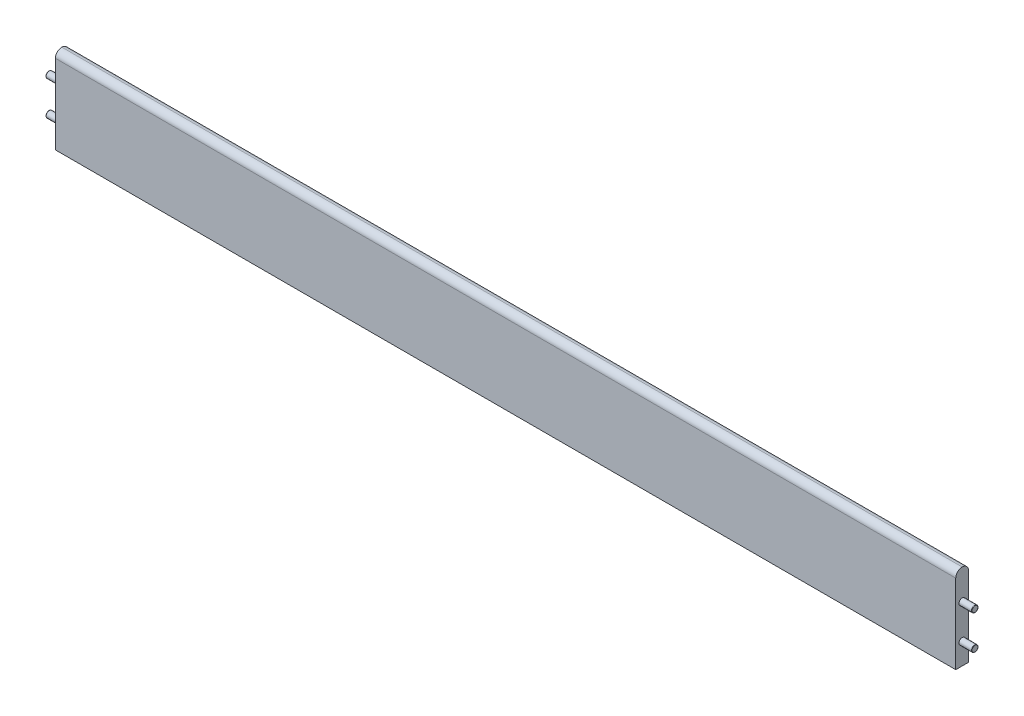
ISO-10303-21;
HEADER;
FILE_DESCRIPTION(('STEP AP214'),'2;1');
FILE_NAME('part.step','',(''),(''),'','','');
FILE_SCHEMA(('AUTOMOTIVE_DESIGN { 1 0 10303 214 1 1 1 1 }'));
ENDSEC;
DATA;
#1=APPLICATION_CONTEXT('core data for automotive mechanical design processes');
#2=APPLICATION_PROTOCOL_DEFINITION('international standard','automotive_design',2000,#1);
#3=PRODUCT_CONTEXT('',#1,'mechanical');
#4=PRODUCT('Part','Part','',(#3));
#5=PRODUCT_RELATED_PRODUCT_CATEGORY('part','',(#4));
#6=PRODUCT_DEFINITION_FORMATION('','',#4);
#7=PRODUCT_DEFINITION_CONTEXT('part definition',#1,'design');
#8=PRODUCT_DEFINITION('design','',#6,#7);
#9=PRODUCT_DEFINITION_SHAPE('','',#8);
#10=(LENGTH_UNIT() NAMED_UNIT(*) SI_UNIT(.MILLI.,.METRE.));
#11=(NAMED_UNIT(*) PLANE_ANGLE_UNIT() SI_UNIT($,.RADIAN.));
#12=(NAMED_UNIT(*) SI_UNIT($,.STERADIAN.) SOLID_ANGLE_UNIT());
#13=UNCERTAINTY_MEASURE_WITH_UNIT(LENGTH_MEASURE(1.E-05),#10,'distance_accuracy_value','');
#14=(GEOMETRIC_REPRESENTATION_CONTEXT(3) GLOBAL_UNCERTAINTY_ASSIGNED_CONTEXT((#13)) GLOBAL_UNIT_ASSIGNED_CONTEXT((#10,
#11,#12)) REPRESENTATION_CONTEXT('',''));
#15=CARTESIAN_POINT('',(0.,0.,0.));
#16=DIRECTION('',(0.,0.,1.));
#17=DIRECTION('',(1.,0.,0.));
#18=AXIS2_PLACEMENT_3D('',#15,#16,#17);
#19=CARTESIAN_POINT('',(0.,0.,30.));
#20=DIRECTION('',(1.,0.,0.));
#21=DIRECTION('',(0.,1.,0.));
#22=AXIS2_PLACEMENT_3D('',#19,#20,#21);
#23=PLANE('',#22);
#24=CARTESIAN_POINT('',(0.,-150.,15.));
#25=DIRECTION('',(1.,0.,0.));
#26=DIRECTION('',(0.,1.,0.));
#27=AXIS2_PLACEMENT_3D('',#24,#25,#26);
#28=CIRCLE('',#27,7.5);
#29=CARTESIAN_POINT('',(0.,-142.5,15.));
#30=VERTEX_POINT('',#29);
#31=EDGE_CURVE('E139',#30,#30,#28,.F.);
#32=ORIENTED_EDGE('',*,*,#31,.F.);
#33=EDGE_LOOP('',(#32));
#34=FACE_BOUND('',#33,.T.);
#35=CARTESIAN_POINT('',(0.,-70.,15.));
#36=DIRECTION('',(1.,0.,0.));
#37=DIRECTION('',(0.,1.,0.));
#38=AXIS2_PLACEMENT_3D('',#35,#36,#37);
#39=CIRCLE('',#38,7.5);
#40=CARTESIAN_POINT('',(0.,-62.5,15.));
#41=VERTEX_POINT('',#40);
#42=EDGE_CURVE('E136',#41,#41,#39,.F.);
#43=ORIENTED_EDGE('',*,*,#42,.F.);
#44=EDGE_LOOP('',(#43));
#45=FACE_BOUND('',#44,.T.);
#46=CARTESIAN_POINT('',(0.,-15.,15.));
#47=DIRECTION('',(1.,0.,0.));
#48=DIRECTION('',(0.,1.,0.));
#49=AXIS2_PLACEMENT_3D('',#46,#47,#48);
#50=CIRCLE('',#49,15.);
#51=CARTESIAN_POINT('',(0.,-15.,30.));
#52=VERTEX_POINT('',#51);
#53=CARTESIAN_POINT('',(0.,0.,15.));
#54=VERTEX_POINT('',#53);
#55=EDGE_CURVE('E101',#52,#54,#50,.F.);
#56=ORIENTED_EDGE('',*,*,#55,.T.);
#57=CARTESIAN_POINT('',(0.,-15.,15.));
#58=DIRECTION('',(1.,0.,0.));
#59=DIRECTION('',(0.,1.,0.));
#60=AXIS2_PLACEMENT_3D('',#57,#58,#59);
#61=CIRCLE('',#60,15.);
#62=CARTESIAN_POINT('',(0.,-15.,0.));
#63=VERTEX_POINT('',#62);
#64=EDGE_CURVE('E103',#54,#63,#61,.F.);
#65=ORIENTED_EDGE('',*,*,#64,.T.);
#66=DIRECTION('',(0.,-1.,0.));
#67=VECTOR('',#66,1.);
#68=CARTESIAN_POINT('',(0.,0.,0.));
#69=LINE('',#68,#67);
#70=CARTESIAN_POINT('',(0.,-200.,0.));
#71=VERTEX_POINT('',#70);
#72=EDGE_CURVE('E99',#63,#71,#69,.T.);
#73=ORIENTED_EDGE('',*,*,#72,.T.);
#74=DIRECTION('',(0.,0.,-1.));
#75=VECTOR('',#74,1.);
#76=CARTESIAN_POINT('',(0.,-200.,30.));
#77=LINE('',#76,#75);
#78=CARTESIAN_POINT('',(0.,-200.,30.));
#79=VERTEX_POINT('',#78);
#80=EDGE_CURVE('E93',#79,#71,#77,.T.);
#81=ORIENTED_EDGE('',*,*,#80,.F.);
#82=DIRECTION('',(0.,-1.,0.));
#83=VECTOR('',#82,1.);
#84=CARTESIAN_POINT('',(0.,0.,30.));
#85=LINE('',#84,#83);
#86=EDGE_CURVE('E78',#52,#79,#85,.T.);
#87=ORIENTED_EDGE('',*,*,#86,.F.);
#88=EDGE_LOOP('',(#56,#65,#73,#81,#87));
#89=FACE_BOUND('',#88,.T.);
#90=ADVANCED_FACE('F33',(#34,#45,#89),#23,.F.);
#91=CARTESIAN_POINT('',(0.,-200.,30.));
#92=DIRECTION('',(0.,1.,0.));
#93=DIRECTION('',(0.,0.,1.));
#94=AXIS2_PLACEMENT_3D('',#91,#92,#93);
#95=PLANE('',#94);
#96=DIRECTION('',(1.,0.,0.));
#97=VECTOR('',#96,1.);
#98=CARTESIAN_POINT('',(0.,-200.,0.));
#99=LINE('',#98,#97);
#100=CARTESIAN_POINT('',(2100.,-200.,0.));
#101=VERTEX_POINT('',#100);
#102=EDGE_CURVE('E227',#71,#101,#99,.T.);
#103=ORIENTED_EDGE('',*,*,#102,.T.);
#104=DIRECTION('',(0.,0.,-1.));
#105=VECTOR('',#104,1.);
#106=CARTESIAN_POINT('',(2100.,-200.,30.));
#107=LINE('',#106,#105);
#108=CARTESIAN_POINT('',(2100.,-200.,30.));
#109=VERTEX_POINT('',#108);
#110=EDGE_CURVE('E95',#109,#101,#107,.T.);
#111=ORIENTED_EDGE('',*,*,#110,.F.);
#112=DIRECTION('',(1.,0.,0.));
#113=VECTOR('',#112,1.);
#114=CARTESIAN_POINT('',(0.,-200.,30.));
#115=LINE('',#114,#113);
#116=EDGE_CURVE('E81',#79,#109,#115,.T.);
#117=ORIENTED_EDGE('',*,*,#116,.F.);
#118=ORIENTED_EDGE('',*,*,#80,.T.);
#119=EDGE_LOOP('',(#103,#111,#117,#118));
#120=FACE_BOUND('',#119,.T.);
#121=ADVANCED_FACE('F92',(#120),#95,.F.);
#122=CARTESIAN_POINT('',(2100.,0.,30.));
#123=DIRECTION('',(-1.,0.,0.));
#124=DIRECTION('',(0.,0.,1.));
#125=AXIS2_PLACEMENT_3D('',#122,#123,#124);
#126=PLANE('',#125);
#127=CARTESIAN_POINT('',(2100.,-150.,15.));
#128=DIRECTION('',(-1.,0.,0.));
#129=DIRECTION('',(0.,0.,1.));
#130=AXIS2_PLACEMENT_3D('',#127,#128,#129);
#131=CIRCLE('',#130,7.5);
#132=CARTESIAN_POINT('',(2100.,-150.,22.5));
#133=VERTEX_POINT('',#132);
#134=EDGE_CURVE('E121',#133,#133,#131,.F.);
#135=ORIENTED_EDGE('',*,*,#134,.F.);
#136=EDGE_LOOP('',(#135));
#137=FACE_BOUND('',#136,.T.);
#138=CARTESIAN_POINT('',(2100.,-70.,15.));
#139=DIRECTION('',(-1.,0.,0.));
#140=DIRECTION('',(0.,0.,1.));
#141=AXIS2_PLACEMENT_3D('',#138,#139,#140);
#142=CIRCLE('',#141,7.5);
#143=CARTESIAN_POINT('',(2100.,-70.,22.5));
#144=VERTEX_POINT('',#143);
#145=EDGE_CURVE('E115',#144,#144,#142,.F.);
#146=ORIENTED_EDGE('',*,*,#145,.F.);
#147=EDGE_LOOP('',(#146));
#148=FACE_BOUND('',#147,.T.);
#149=DIRECTION('',(0.,1.,0.));
#150=VECTOR('',#149,1.);
#151=CARTESIAN_POINT('',(2100.,0.,0.));
#152=LINE('',#151,#150);
#153=CARTESIAN_POINT('',(2100.,-15.,0.));
#154=VERTEX_POINT('',#153);
#155=EDGE_CURVE('E88',#101,#154,#152,.T.);
#156=ORIENTED_EDGE('',*,*,#155,.T.);
#157=CARTESIAN_POINT('',(2100.,-15.,15.));
#158=DIRECTION('',(-1.,0.,0.));
#159=DIRECTION('',(0.,0.,1.));
#160=AXIS2_PLACEMENT_3D('',#157,#158,#159);
#161=CIRCLE('',#160,15.);
#162=CARTESIAN_POINT('',(2100.,0.,15.));
#163=VERTEX_POINT('',#162);
#164=EDGE_CURVE('E53',#154,#163,#161,.F.);
#165=ORIENTED_EDGE('',*,*,#164,.T.);
#166=CARTESIAN_POINT('',(2100.,-15.,15.));
#167=DIRECTION('',(-1.,0.,0.));
#168=DIRECTION('',(0.,0.,1.));
#169=AXIS2_PLACEMENT_3D('',#166,#167,#168);
#170=CIRCLE('',#169,15.);
#171=CARTESIAN_POINT('',(2100.,-15.,30.));
#172=VERTEX_POINT('',#171);
#173=EDGE_CURVE('E48',#163,#172,#170,.F.);
#174=ORIENTED_EDGE('',*,*,#173,.T.);
#175=DIRECTION('',(0.,1.,0.));
#176=VECTOR('',#175,1.);
#177=CARTESIAN_POINT('',(2100.,0.,30.));
#178=LINE('',#177,#176);
#179=EDGE_CURVE('E96',#109,#172,#178,.T.);
#180=ORIENTED_EDGE('',*,*,#179,.F.);
#181=ORIENTED_EDGE('',*,*,#110,.T.);
#182=EDGE_LOOP('',(#156,#165,#174,#180,#181));
#183=FACE_BOUND('',#182,.T.);
#184=ADVANCED_FACE('F167',(#137,#148,#183),#126,.F.);
#185=CARTESIAN_POINT('',(0.,0.,30.));
#186=DIRECTION('',(0.,0.,1.));
#187=DIRECTION('',(1.,0.,0.));
#188=AXIS2_PLACEMENT_3D('',#185,#186,#187);
#189=PLANE('',#188);
#190=ORIENTED_EDGE('',*,*,#179,.T.);
#191=DIRECTION('',(-1.,0.,0.));
#192=VECTOR('',#191,1.);
#193=CARTESIAN_POINT('',(0.,-15.,30.));
#194=LINE('',#193,#192);
#195=EDGE_CURVE('E84',#172,#52,#194,.T.);
#196=ORIENTED_EDGE('',*,*,#195,.T.);
#197=ORIENTED_EDGE('',*,*,#86,.T.);
#198=ORIENTED_EDGE('',*,*,#116,.T.);
#199=EDGE_LOOP('',(#190,#196,#197,#198));
#200=FACE_BOUND('',#199,.T.);
#201=ADVANCED_FACE('F80',(#200),#189,.T.);
#202=CARTESIAN_POINT('',(0.,0.,0.));
#203=DIRECTION('',(0.,0.,1.));
#204=DIRECTION('',(1.,0.,0.));
#205=AXIS2_PLACEMENT_3D('',#202,#203,#204);
#206=PLANE('',#205);
#207=ORIENTED_EDGE('',*,*,#72,.F.);
#208=DIRECTION('',(-1.,0.,0.));
#209=VECTOR('',#208,1.);
#210=CARTESIAN_POINT('',(0.,-15.,0.));
#211=LINE('',#210,#209);
#212=EDGE_CURVE('E109',#63,#154,#211,.F.);
#213=ORIENTED_EDGE('',*,*,#212,.T.);
#214=ORIENTED_EDGE('',*,*,#155,.F.);
#215=ORIENTED_EDGE('',*,*,#102,.F.);
#216=EDGE_LOOP('',(#207,#213,#214,#215));
#217=FACE_BOUND('',#216,.T.);
#218=ADVANCED_FACE('F181',(#217),#206,.F.);
#219=CARTESIAN_POINT('',(0.,-15.,15.));
#220=DIRECTION('',(1.,0.,0.));
#221=DIRECTION('',(0.,0.,-1.));
#222=AXIS2_PLACEMENT_3D('',#219,#220,#221);
#223=CYLINDRICAL_SURFACE('',#222,15.);
#224=ORIENTED_EDGE('',*,*,#195,.F.);
#225=ORIENTED_EDGE('',*,*,#173,.F.);
#226=DIRECTION('',(-1.,0.,0.));
#227=VECTOR('',#226,1.);
#228=CARTESIAN_POINT('',(2100.,0.,15.));
#229=LINE('',#228,#227);
#230=EDGE_CURVE('E116',#54,#163,#229,.F.);
#231=ORIENTED_EDGE('',*,*,#230,.F.);
#232=ORIENTED_EDGE('',*,*,#55,.F.);
#233=EDGE_LOOP('',(#224,#225,#231,#232));
#234=FACE_BOUND('',#233,.T.);
#235=ADVANCED_FACE('F177',(#234),#223,.T.);
#236=CARTESIAN_POINT('',(0.,-15.,15.));
#237=DIRECTION('',(-1.,0.,0.));
#238=DIRECTION('',(0.,0.,1.));
#239=AXIS2_PLACEMENT_3D('',#236,#237,#238);
#240=CYLINDRICAL_SURFACE('',#239,15.);
#241=ORIENTED_EDGE('',*,*,#164,.F.);
#242=ORIENTED_EDGE('',*,*,#212,.F.);
#243=ORIENTED_EDGE('',*,*,#64,.F.);
#244=ORIENTED_EDGE('',*,*,#230,.T.);
#245=EDGE_LOOP('',(#241,#242,#243,#244));
#246=FACE_BOUND('',#245,.T.);
#247=ADVANCED_FACE('F173',(#246),#240,.T.);
#248=CARTESIAN_POINT('',(2130.,-70.,15.));
#249=DIRECTION('',(-1.,0.,0.));
#250=DIRECTION('',(0.,0.,1.));
#251=AXIS2_PLACEMENT_3D('',#248,#249,#250);
#252=CYLINDRICAL_SURFACE('',#251,7.5);
#253=CARTESIAN_POINT('',(2129.,-70.,15.));
#254=DIRECTION('',(1.,0.,0.));
#255=DIRECTION('',(0.,0.,-1.));
#256=AXIS2_PLACEMENT_3D('',#253,#254,#255);
#257=CIRCLE('',#256,7.5);
#258=CARTESIAN_POINT('',(2129.,-70.,7.5));
#259=VERTEX_POINT('',#258);
#260=EDGE_CURVE('E133',#259,#259,#257,.F.);
#261=ORIENTED_EDGE('',*,*,#260,.T.);
#262=EDGE_LOOP('',(#261));
#263=FACE_BOUND('',#262,.T.);
#264=ORIENTED_EDGE('',*,*,#145,.T.);
#265=EDGE_LOOP('',(#264));
#266=FACE_BOUND('',#265,.T.);
#267=ADVANCED_FACE('F176',(#263,#266),#252,.T.);
#268=CARTESIAN_POINT('',(2130.,-70.,15.));
#269=DIRECTION('',(1.,0.,0.));
#270=DIRECTION('',(0.,0.,-1.));
#271=AXIS2_PLACEMENT_3D('',#268,#269,#270);
#272=PLANE('',#271);
#273=CARTESIAN_POINT('',(2130.,-70.,15.));
#274=DIRECTION('',(1.,0.,0.));
#275=DIRECTION('',(0.,0.,-1.));
#276=AXIS2_PLACEMENT_3D('',#273,#274,#275);
#277=CIRCLE('',#276,6.5);
#278=CARTESIAN_POINT('',(2130.,-70.,8.49999999999999));
#279=VERTEX_POINT('',#278);
#280=EDGE_CURVE('E130',#279,#279,#277,.T.);
#281=ORIENTED_EDGE('',*,*,#280,.T.);
#282=EDGE_LOOP('',(#281));
#283=FACE_BOUND('',#282,.T.);
#284=ADVANCED_FACE('F201',(#283),#272,.T.);
#285=CARTESIAN_POINT('',(2130.,-150.,15.));
#286=DIRECTION('',(-1.,0.,0.));
#287=DIRECTION('',(0.,0.,1.));
#288=AXIS2_PLACEMENT_3D('',#285,#286,#287);
#289=CYLINDRICAL_SURFACE('',#288,7.5);
#290=CARTESIAN_POINT('',(2129.,-150.,15.));
#291=DIRECTION('',(1.,0.,0.));
#292=DIRECTION('',(0.,0.,-1.));
#293=AXIS2_PLACEMENT_3D('',#290,#291,#292);
#294=CIRCLE('',#293,7.5);
#295=CARTESIAN_POINT('',(2129.,-150.,7.5));
#296=VERTEX_POINT('',#295);
#297=EDGE_CURVE('E127',#296,#296,#294,.F.);
#298=ORIENTED_EDGE('',*,*,#297,.T.);
#299=EDGE_LOOP('',(#298));
#300=FACE_BOUND('',#299,.T.);
#301=ORIENTED_EDGE('',*,*,#134,.T.);
#302=EDGE_LOOP('',(#301));
#303=FACE_BOUND('',#302,.T.);
#304=ADVANCED_FACE('F203',(#300,#303),#289,.T.);
#305=CARTESIAN_POINT('',(2130.,-150.,15.));
#306=DIRECTION('',(1.,0.,0.));
#307=DIRECTION('',(0.,0.,-1.));
#308=AXIS2_PLACEMENT_3D('',#305,#306,#307);
#309=PLANE('',#308);
#310=CARTESIAN_POINT('',(2130.,-150.,15.));
#311=DIRECTION('',(1.,0.,0.));
#312=DIRECTION('',(0.,0.,-1.));
#313=AXIS2_PLACEMENT_3D('',#310,#311,#312);
#314=CIRCLE('',#313,6.5);
#315=CARTESIAN_POINT('',(2130.,-150.,8.5));
#316=VERTEX_POINT('',#315);
#317=EDGE_CURVE('E124',#316,#316,#314,.T.);
#318=ORIENTED_EDGE('',*,*,#317,.T.);
#319=EDGE_LOOP('',(#318));
#320=FACE_BOUND('',#319,.T.);
#321=ADVANCED_FACE('F187',(#320),#309,.T.);
#322=CARTESIAN_POINT('',(2129.,-150.,15.));
#323=DIRECTION('',(1.,0.,0.));
#324=DIRECTION('',(0.,0.,-1.));
#325=AXIS2_PLACEMENT_3D('',#322,#323,#324);
#326=TOROIDAL_SURFACE('',#325,6.5,1.);
#327=ORIENTED_EDGE('',*,*,#297,.F.);
#328=EDGE_LOOP('',(#327));
#329=FACE_BOUND('',#328,.T.);
#330=ORIENTED_EDGE('',*,*,#317,.F.);
#331=EDGE_LOOP('',(#330));
#332=FACE_BOUND('',#331,.T.);
#333=ADVANCED_FACE('F183',(#329,#332),#326,.T.);
#334=CARTESIAN_POINT('',(2129.,-70.,15.));
#335=DIRECTION('',(1.,0.,0.));
#336=DIRECTION('',(0.,0.,-1.));
#337=AXIS2_PLACEMENT_3D('',#334,#335,#336);
#338=TOROIDAL_SURFACE('',#337,6.5,1.);
#339=ORIENTED_EDGE('',*,*,#260,.F.);
#340=EDGE_LOOP('',(#339));
#341=FACE_BOUND('',#340,.T.);
#342=ORIENTED_EDGE('',*,*,#280,.F.);
#343=EDGE_LOOP('',(#342));
#344=FACE_BOUND('',#343,.T.);
#345=ADVANCED_FACE('F186',(#341,#344),#338,.T.);
#346=CARTESIAN_POINT('',(-30.,-70.,15.));
#347=DIRECTION('',(1.,0.,0.));
#348=DIRECTION('',(0.,1.,0.));
#349=AXIS2_PLACEMENT_3D('',#346,#347,#348);
#350=CYLINDRICAL_SURFACE('',#349,7.5);
#351=CARTESIAN_POINT('',(-29.,-70.,15.));
#352=DIRECTION('',(-1.,0.,0.));
#353=DIRECTION('',(0.,-1.,0.));
#354=AXIS2_PLACEMENT_3D('',#351,#352,#353);
#355=CIRCLE('',#354,7.5);
#356=CARTESIAN_POINT('',(-29.,-77.5,15.));
#357=VERTEX_POINT('',#356);
#358=EDGE_CURVE('E11',#357,#357,#355,.F.);
#359=ORIENTED_EDGE('',*,*,#358,.T.);
#360=EDGE_LOOP('',(#359));
#361=FACE_BOUND('',#360,.T.);
#362=ORIENTED_EDGE('',*,*,#42,.T.);
#363=EDGE_LOOP('',(#362));
#364=FACE_BOUND('',#363,.T.);
#365=ADVANCED_FACE('F190',(#361,#364),#350,.T.);
#366=CARTESIAN_POINT('',(-30.,-70.,15.));
#367=DIRECTION('',(-1.,0.,0.));
#368=DIRECTION('',(0.,-1.,0.));
#369=AXIS2_PLACEMENT_3D('',#366,#367,#368);
#370=PLANE('',#369);
#371=CARTESIAN_POINT('',(-30.,-70.,15.));
#372=DIRECTION('',(-1.,0.,0.));
#373=DIRECTION('',(0.,-1.,0.));
#374=AXIS2_PLACEMENT_3D('',#371,#372,#373);
#375=CIRCLE('',#374,6.5);
#376=CARTESIAN_POINT('',(-30.,-76.5,15.));
#377=VERTEX_POINT('',#376);
#378=EDGE_CURVE('E41',#377,#377,#375,.T.);
#379=ORIENTED_EDGE('',*,*,#378,.T.);
#380=EDGE_LOOP('',(#379));
#381=FACE_BOUND('',#380,.T.);
#382=ADVANCED_FACE('F150',(#381),#370,.T.);
#383=CARTESIAN_POINT('',(-30.,-150.,15.));
#384=DIRECTION('',(1.,0.,0.));
#385=DIRECTION('',(0.,1.,0.));
#386=AXIS2_PLACEMENT_3D('',#383,#384,#385);
#387=CYLINDRICAL_SURFACE('',#386,7.5);
#388=CARTESIAN_POINT('',(-29.,-150.,15.));
#389=DIRECTION('',(-1.,0.,0.));
#390=DIRECTION('',(0.,-1.,0.));
#391=AXIS2_PLACEMENT_3D('',#388,#389,#390);
#392=CIRCLE('',#391,7.5);
#393=CARTESIAN_POINT('',(-29.,-157.5,15.));
#394=VERTEX_POINT('',#393);
#395=EDGE_CURVE('E145',#394,#394,#392,.F.);
#396=ORIENTED_EDGE('',*,*,#395,.T.);
#397=EDGE_LOOP('',(#396));
#398=FACE_BOUND('',#397,.T.);
#399=ORIENTED_EDGE('',*,*,#31,.T.);
#400=EDGE_LOOP('',(#399));
#401=FACE_BOUND('',#400,.T.);
#402=ADVANCED_FACE('F306',(#398,#401),#387,.T.);
#403=CARTESIAN_POINT('',(-30.,-150.,15.));
#404=DIRECTION('',(-1.,0.,0.));
#405=DIRECTION('',(0.,-1.,0.));
#406=AXIS2_PLACEMENT_3D('',#403,#404,#405);
#407=PLANE('',#406);
#408=CARTESIAN_POINT('',(-30.,-150.,15.));
#409=DIRECTION('',(-1.,0.,0.));
#410=DIRECTION('',(0.,-1.,0.));
#411=AXIS2_PLACEMENT_3D('',#408,#409,#410);
#412=CIRCLE('',#411,6.5);
#413=CARTESIAN_POINT('',(-30.,-156.5,15.));
#414=VERTEX_POINT('',#413);
#415=EDGE_CURVE('E142',#414,#414,#412,.T.);
#416=ORIENTED_EDGE('',*,*,#415,.T.);
#417=EDGE_LOOP('',(#416));
#418=FACE_BOUND('',#417,.T.);
#419=ADVANCED_FACE('F158',(#418),#407,.T.);
#420=CARTESIAN_POINT('',(-29.,-150.,15.));
#421=DIRECTION('',(-1.,0.,0.));
#422=DIRECTION('',(0.,-1.,0.));
#423=AXIS2_PLACEMENT_3D('',#420,#421,#422);
#424=TOROIDAL_SURFACE('',#423,6.5,1.);
#425=ORIENTED_EDGE('',*,*,#395,.F.);
#426=EDGE_LOOP('',(#425));
#427=FACE_BOUND('',#426,.T.);
#428=ORIENTED_EDGE('',*,*,#415,.F.);
#429=EDGE_LOOP('',(#428));
#430=FACE_BOUND('',#429,.T.);
#431=ADVANCED_FACE('F153',(#427,#430),#424,.T.);
#432=CARTESIAN_POINT('',(-29.,-70.,15.));
#433=DIRECTION('',(-1.,0.,0.));
#434=DIRECTION('',(0.,-1.,0.));
#435=AXIS2_PLACEMENT_3D('',#432,#433,#434);
#436=TOROIDAL_SURFACE('',#435,6.5,1.);
#437=ORIENTED_EDGE('',*,*,#358,.F.);
#438=EDGE_LOOP('',(#437));
#439=FACE_BOUND('',#438,.T.);
#440=ORIENTED_EDGE('',*,*,#378,.F.);
#441=EDGE_LOOP('',(#440));
#442=FACE_BOUND('',#441,.T.);
#443=ADVANCED_FACE('F35',(#439,#442),#436,.T.);
#444=CLOSED_SHELL('',(#90,#121,#184,#201,#218,#235,#247,#267,#284,#304,#321,#333,#345,#365,#382,
#402,#419,#431,#443));
#445=MANIFOLD_SOLID_BREP('B2',#444);
#446=ADVANCED_BREP_SHAPE_REPRESENTATION('',(#18,#445),#14);
#447=SHAPE_DEFINITION_REPRESENTATION(#9,#446);
ENDSEC;
END-ISO-10303-21;
